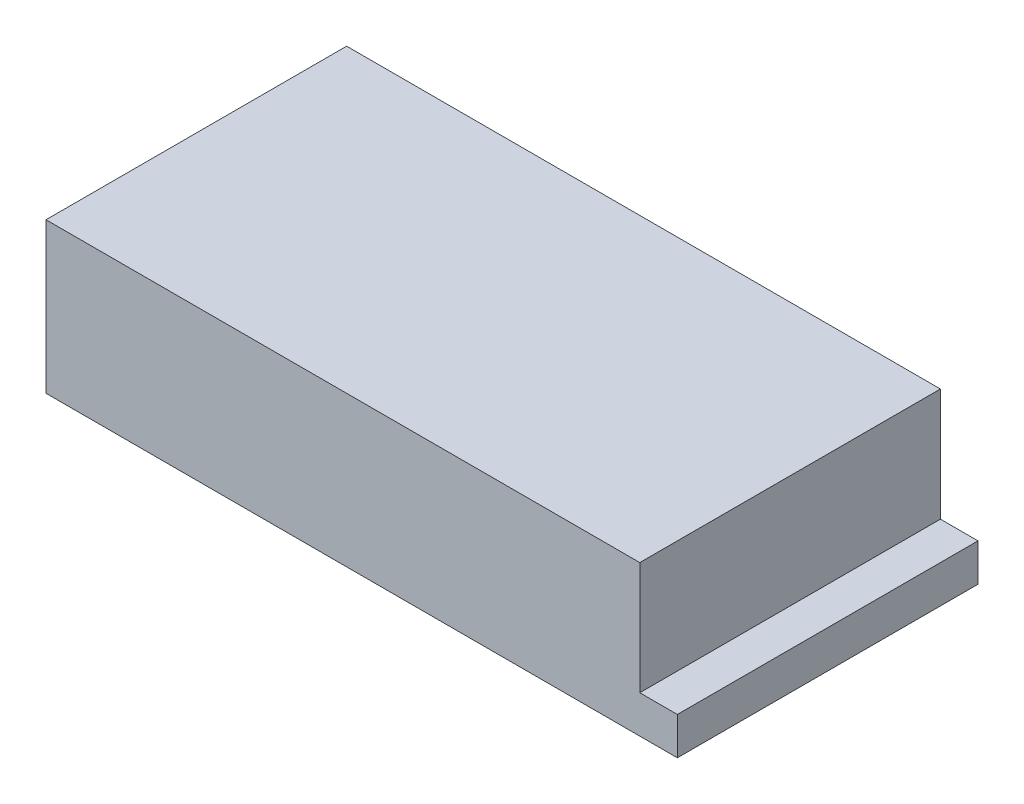
ISO-10303-21;
HEADER;
FILE_DESCRIPTION(('STEP AP214'),'2;1');
FILE_NAME('part.step','',(''),(''),'','','');
FILE_SCHEMA(('AUTOMOTIVE_DESIGN { 1 0 10303 214 1 1 1 1 }'));
ENDSEC;
DATA;
#1=APPLICATION_CONTEXT('core data for automotive mechanical design processes');
#2=APPLICATION_PROTOCOL_DEFINITION('international standard','automotive_design',2000,#1);
#3=PRODUCT_CONTEXT('',#1,'mechanical');
#4=PRODUCT('Part','Part','',(#3));
#5=PRODUCT_RELATED_PRODUCT_CATEGORY('part','',(#4));
#6=PRODUCT_DEFINITION_FORMATION('','',#4);
#7=PRODUCT_DEFINITION_CONTEXT('part definition',#1,'design');
#8=PRODUCT_DEFINITION('design','',#6,#7);
#9=PRODUCT_DEFINITION_SHAPE('','',#8);
#10=(LENGTH_UNIT() NAMED_UNIT(*) SI_UNIT(.MILLI.,.METRE.));
#11=(NAMED_UNIT(*) PLANE_ANGLE_UNIT() SI_UNIT($,.RADIAN.));
#12=(NAMED_UNIT(*) SI_UNIT($,.STERADIAN.) SOLID_ANGLE_UNIT());
#13=UNCERTAINTY_MEASURE_WITH_UNIT(LENGTH_MEASURE(1.E-05),#10,'distance_accuracy_value','');
#14=(GEOMETRIC_REPRESENTATION_CONTEXT(3) GLOBAL_UNCERTAINTY_ASSIGNED_CONTEXT((#13)) GLOBAL_UNIT_ASSIGNED_CONTEXT((#10,
#11,#12)) REPRESENTATION_CONTEXT('',''));
#15=CARTESIAN_POINT('',(0.,0.,0.));
#16=DIRECTION('',(0.,0.,1.));
#17=DIRECTION('',(1.,0.,0.));
#18=AXIS2_PLACEMENT_3D('',#15,#16,#17);
#19=CARTESIAN_POINT('',(-48.3824924399172,40.,80.));
#20=DIRECTION('',(1.,0.,0.));
#21=DIRECTION('',(0.,0.,-1.));
#22=AXIS2_PLACEMENT_3D('',#19,#20,#21);
#23=PLANE('',#22);
#24=DIRECTION('',(0.,-1.,0.));
#25=VECTOR('',#24,1.);
#26=CARTESIAN_POINT('',(-48.3824924399172,40.,0.));
#27=LINE('',#26,#25);
#28=CARTESIAN_POINT('',(-48.3824924399172,40.,0.));
#29=VERTEX_POINT('',#28);
#30=CARTESIAN_POINT('',(-48.3824924399172,0.,0.));
#31=VERTEX_POINT('',#30);
#32=EDGE_CURVE('E119',#29,#31,#27,.T.);
#33=ORIENTED_EDGE('',*,*,#32,.T.);
#34=DIRECTION('',(0.,0.,-1.));
#35=VECTOR('',#34,1.);
#36=CARTESIAN_POINT('',(-48.3824924399172,0.,80.));
#37=LINE('',#36,#35);
#38=CARTESIAN_POINT('',(-48.3824924399172,0.,80.));
#39=VERTEX_POINT('',#38);
#40=EDGE_CURVE('E11',#39,#31,#37,.T.);
#41=ORIENTED_EDGE('',*,*,#40,.F.);
#42=DIRECTION('',(0.,-1.,0.));
#43=VECTOR('',#42,1.);
#44=CARTESIAN_POINT('',(-48.3824924399172,40.,80.));
#45=LINE('',#44,#43);
#46=CARTESIAN_POINT('',(-48.3824924399172,40.,80.));
#47=VERTEX_POINT('',#46);
#48=EDGE_CURVE('E129',#47,#39,#45,.T.);
#49=ORIENTED_EDGE('',*,*,#48,.F.);
#50=DIRECTION('',(0.,0.,-1.));
#51=VECTOR('',#50,1.);
#52=CARTESIAN_POINT('',(-48.3824924399172,40.,80.));
#53=LINE('',#52,#51);
#54=EDGE_CURVE('E115',#47,#29,#53,.T.);
#55=ORIENTED_EDGE('',*,*,#54,.T.);
#56=EDGE_LOOP('',(#33,#41,#49,#55));
#57=FACE_BOUND('',#56,.T.);
#58=ADVANCED_FACE('F35',(#57),#23,.F.);
#59=CARTESIAN_POINT('',(-48.3824924399172,0.,80.));
#60=DIRECTION('',(0.,1.,0.));
#61=DIRECTION('',(0.,0.,1.));
#62=AXIS2_PLACEMENT_3D('',#59,#60,#61);
#63=PLANE('',#62);
#64=DIRECTION('',(1.,0.,0.));
#65=VECTOR('',#64,1.);
#66=CARTESIAN_POINT('',(-48.3824924399172,0.,0.));
#67=LINE('',#66,#65);
#68=CARTESIAN_POINT('',(119.617507560083,0.,0.));
#69=VERTEX_POINT('',#68);
#70=EDGE_CURVE('E122',#31,#69,#67,.T.);
#71=ORIENTED_EDGE('',*,*,#70,.T.);
#72=DIRECTION('',(0.,0.,-1.));
#73=VECTOR('',#72,1.);
#74=CARTESIAN_POINT('',(119.617507560083,0.,80.));
#75=LINE('',#74,#73);
#76=CARTESIAN_POINT('',(119.617507560083,0.,80.));
#77=VERTEX_POINT('',#76);
#78=EDGE_CURVE('E43',#77,#69,#75,.T.);
#79=ORIENTED_EDGE('',*,*,#78,.F.);
#80=DIRECTION('',(1.,0.,0.));
#81=VECTOR('',#80,1.);
#82=CARTESIAN_POINT('',(-48.3824924399172,0.,80.));
#83=LINE('',#82,#81);
#84=EDGE_CURVE('E88',#39,#77,#83,.T.);
#85=ORIENTED_EDGE('',*,*,#84,.F.);
#86=ORIENTED_EDGE('',*,*,#40,.T.);
#87=EDGE_LOOP('',(#71,#79,#85,#86));
#88=FACE_BOUND('',#87,.T.);
#89=ADVANCED_FACE('F153',(#88),#63,.F.);
#90=CARTESIAN_POINT('',(119.617507560083,0.,80.));
#91=DIRECTION('',(-1.,0.,0.));
#92=DIRECTION('',(0.,0.,1.));
#93=AXIS2_PLACEMENT_3D('',#90,#91,#92);
#94=PLANE('',#93);
#95=DIRECTION('',(0.,1.,0.));
#96=VECTOR('',#95,1.);
#97=CARTESIAN_POINT('',(119.617507560083,0.,0.));
#98=LINE('',#97,#96);
#99=CARTESIAN_POINT('',(119.617507560083,10.,0.));
#100=VERTEX_POINT('',#99);
#101=EDGE_CURVE('E124',#69,#100,#98,.T.);
#102=ORIENTED_EDGE('',*,*,#101,.T.);
#103=DIRECTION('',(0.,0.,-1.));
#104=VECTOR('',#103,1.);
#105=CARTESIAN_POINT('',(119.617507560083,10.,80.));
#106=LINE('',#105,#104);
#107=CARTESIAN_POINT('',(119.617507560083,10.,80.));
#108=VERTEX_POINT('',#107);
#109=EDGE_CURVE('E110',#108,#100,#106,.T.);
#110=ORIENTED_EDGE('',*,*,#109,.F.);
#111=DIRECTION('',(0.,1.,0.));
#112=VECTOR('',#111,1.);
#113=CARTESIAN_POINT('',(119.617507560083,0.,80.));
#114=LINE('',#113,#112);
#115=EDGE_CURVE('E101',#77,#108,#114,.T.);
#116=ORIENTED_EDGE('',*,*,#115,.F.);
#117=ORIENTED_EDGE('',*,*,#78,.T.);
#118=EDGE_LOOP('',(#102,#110,#116,#117));
#119=FACE_BOUND('',#118,.T.);
#120=ADVANCED_FACE('F135',(#119),#94,.F.);
#121=CARTESIAN_POINT('',(119.617507560083,10.,80.));
#122=DIRECTION('',(0.,-1.,0.));
#123=DIRECTION('',(0.,0.,-1.));
#124=AXIS2_PLACEMENT_3D('',#121,#122,#123);
#125=PLANE('',#124);
#126=DIRECTION('',(-1.,0.,0.));
#127=VECTOR('',#126,1.);
#128=CARTESIAN_POINT('',(119.617507560083,10.,0.));
#129=LINE('',#128,#127);
#130=CARTESIAN_POINT('',(109.617507560083,10.,0.));
#131=VERTEX_POINT('',#130);
#132=EDGE_CURVE('E109',#100,#131,#129,.T.);
#133=ORIENTED_EDGE('',*,*,#132,.T.);
#134=DIRECTION('',(0.,0.,-1.));
#135=VECTOR('',#134,1.);
#136=CARTESIAN_POINT('',(109.617507560083,10.,80.));
#137=LINE('',#136,#135);
#138=CARTESIAN_POINT('',(109.617507560083,10.,80.));
#139=VERTEX_POINT('',#138);
#140=EDGE_CURVE('E106',#139,#131,#137,.T.);
#141=ORIENTED_EDGE('',*,*,#140,.F.);
#142=DIRECTION('',(-1.,0.,0.));
#143=VECTOR('',#142,1.);
#144=CARTESIAN_POINT('',(119.617507560083,10.,80.));
#145=LINE('',#144,#143);
#146=EDGE_CURVE('E95',#108,#139,#145,.T.);
#147=ORIENTED_EDGE('',*,*,#146,.F.);
#148=ORIENTED_EDGE('',*,*,#109,.T.);
#149=EDGE_LOOP('',(#133,#141,#147,#148));
#150=FACE_BOUND('',#149,.T.);
#151=ADVANCED_FACE('F107',(#150),#125,.F.);
#152=CARTESIAN_POINT('',(109.617507560083,10.,80.));
#153=DIRECTION('',(-1.,0.,0.));
#154=DIRECTION('',(0.,0.,1.));
#155=AXIS2_PLACEMENT_3D('',#152,#153,#154);
#156=PLANE('',#155);
#157=DIRECTION('',(0.,1.,0.));
#158=VECTOR('',#157,1.);
#159=CARTESIAN_POINT('',(109.617507560083,10.,0.));
#160=LINE('',#159,#158);
#161=CARTESIAN_POINT('',(109.617507560083,40.,0.));
#162=VERTEX_POINT('',#161);
#163=EDGE_CURVE('E74',#131,#162,#160,.T.);
#164=ORIENTED_EDGE('',*,*,#163,.T.);
#165=DIRECTION('',(0.,0.,-1.));
#166=VECTOR('',#165,1.);
#167=CARTESIAN_POINT('',(109.617507560083,40.,80.));
#168=LINE('',#167,#166);
#169=CARTESIAN_POINT('',(109.617507560083,40.,80.));
#170=VERTEX_POINT('',#169);
#171=EDGE_CURVE('E111',#170,#162,#168,.T.);
#172=ORIENTED_EDGE('',*,*,#171,.F.);
#173=DIRECTION('',(0.,1.,0.));
#174=VECTOR('',#173,1.);
#175=CARTESIAN_POINT('',(109.617507560083,10.,80.));
#176=LINE('',#175,#174);
#177=EDGE_CURVE('E99',#139,#170,#176,.T.);
#178=ORIENTED_EDGE('',*,*,#177,.F.);
#179=ORIENTED_EDGE('',*,*,#140,.T.);
#180=EDGE_LOOP('',(#164,#172,#178,#179));
#181=FACE_BOUND('',#180,.T.);
#182=ADVANCED_FACE('F113',(#181),#156,.F.);
#183=CARTESIAN_POINT('',(109.617507560083,40.,80.));
#184=DIRECTION('',(0.,-1.,0.));
#185=DIRECTION('',(0.,0.,-1.));
#186=AXIS2_PLACEMENT_3D('',#183,#184,#185);
#187=PLANE('',#186);
#188=DIRECTION('',(-1.,0.,0.));
#189=VECTOR('',#188,1.);
#190=CARTESIAN_POINT('',(109.617507560083,40.,0.));
#191=LINE('',#190,#189);
#192=EDGE_CURVE('E80',#162,#29,#191,.T.);
#193=ORIENTED_EDGE('',*,*,#192,.T.);
#194=ORIENTED_EDGE('',*,*,#54,.F.);
#195=DIRECTION('',(-1.,0.,0.));
#196=VECTOR('',#195,1.);
#197=CARTESIAN_POINT('',(109.617507560083,40.,80.));
#198=LINE('',#197,#196);
#199=EDGE_CURVE('E51',#170,#47,#198,.T.);
#200=ORIENTED_EDGE('',*,*,#199,.F.);
#201=ORIENTED_EDGE('',*,*,#171,.T.);
#202=EDGE_LOOP('',(#193,#194,#200,#201));
#203=FACE_BOUND('',#202,.T.);
#204=ADVANCED_FACE('F142',(#203),#187,.F.);
#205=CARTESIAN_POINT('',(0.,0.,80.));
#206=DIRECTION('',(0.,0.,1.));
#207=DIRECTION('',(1.,0.,0.));
#208=AXIS2_PLACEMENT_3D('',#205,#206,#207);
#209=PLANE('',#208);
#210=ORIENTED_EDGE('',*,*,#48,.T.);
#211=ORIENTED_EDGE('',*,*,#84,.T.);
#212=ORIENTED_EDGE('',*,*,#115,.T.);
#213=ORIENTED_EDGE('',*,*,#146,.T.);
#214=ORIENTED_EDGE('',*,*,#177,.T.);
#215=ORIENTED_EDGE('',*,*,#199,.T.);
#216=EDGE_LOOP('',(#210,#211,#212,#213,#214,#215));
#217=FACE_BOUND('',#216,.T.);
#218=ADVANCED_FACE('F97',(#217),#209,.T.);
#219=CARTESIAN_POINT('',(0.,0.,0.));
#220=DIRECTION('',(0.,0.,1.));
#221=DIRECTION('',(1.,0.,0.));
#222=AXIS2_PLACEMENT_3D('',#219,#220,#221);
#223=PLANE('',#222);
#224=ORIENTED_EDGE('',*,*,#32,.F.);
#225=ORIENTED_EDGE('',*,*,#192,.F.);
#226=ORIENTED_EDGE('',*,*,#163,.F.);
#227=ORIENTED_EDGE('',*,*,#132,.F.);
#228=ORIENTED_EDGE('',*,*,#101,.F.);
#229=ORIENTED_EDGE('',*,*,#70,.F.);
#230=EDGE_LOOP('',(#224,#225,#226,#227,#228,#229));
#231=FACE_BOUND('',#230,.T.);
#232=ADVANCED_FACE('F138',(#231),#223,.F.);
#233=CLOSED_SHELL('',(#58,#89,#120,#151,#182,#204,#218,#232));
#234=MANIFOLD_SOLID_BREP('B2',#233);
#235=ADVANCED_BREP_SHAPE_REPRESENTATION('',(#18,#234),#14);
#236=SHAPE_DEFINITION_REPRESENTATION(#9,#235);
ENDSEC;
END-ISO-10303-21;
